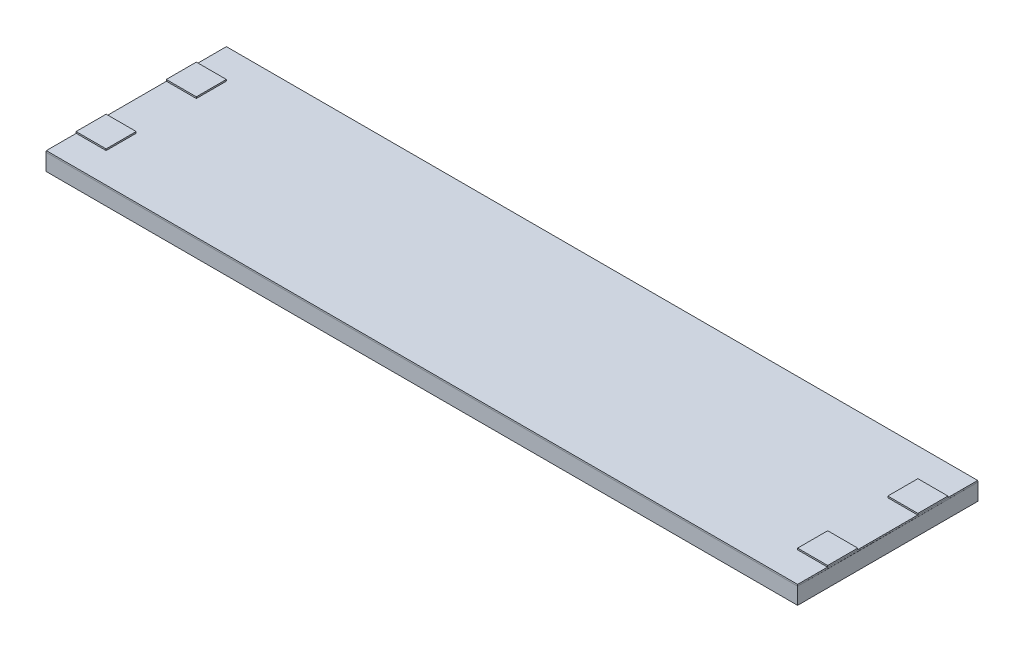
ISO-10303-21;
HEADER;
FILE_DESCRIPTION(('STEP AP214'),'2;1');
FILE_NAME('part.step','',(''),(''),'','','');
FILE_SCHEMA(('AUTOMOTIVE_DESIGN { 1 0 10303 214 1 1 1 1 }'));
ENDSEC;
DATA;
#1=APPLICATION_CONTEXT('core data for automotive mechanical design processes');
#2=APPLICATION_PROTOCOL_DEFINITION('international standard','automotive_design',2000,#1);
#3=PRODUCT_CONTEXT('',#1,'mechanical');
#4=PRODUCT('Part','Part','',(#3));
#5=PRODUCT_RELATED_PRODUCT_CATEGORY('part','',(#4));
#6=PRODUCT_DEFINITION_FORMATION('','',#4);
#7=PRODUCT_DEFINITION_CONTEXT('part definition',#1,'design');
#8=PRODUCT_DEFINITION('design','',#6,#7);
#9=PRODUCT_DEFINITION_SHAPE('','',#8);
#10=(LENGTH_UNIT() NAMED_UNIT(*) SI_UNIT(.MILLI.,.METRE.));
#11=(NAMED_UNIT(*) PLANE_ANGLE_UNIT() SI_UNIT($,.RADIAN.));
#12=(NAMED_UNIT(*) SI_UNIT($,.STERADIAN.) SOLID_ANGLE_UNIT());
#13=UNCERTAINTY_MEASURE_WITH_UNIT(LENGTH_MEASURE(1.E-05),#10,'distance_accuracy_value','');
#14=(GEOMETRIC_REPRESENTATION_CONTEXT(3) GLOBAL_UNCERTAINTY_ASSIGNED_CONTEXT((#13)) GLOBAL_UNIT_ASSIGNED_CONTEXT((#10,
#11,#12)) REPRESENTATION_CONTEXT('',''));
#15=CARTESIAN_POINT('',(0.,0.,0.));
#16=DIRECTION('',(0.,0.,1.));
#17=DIRECTION('',(1.,0.,0.));
#18=AXIS2_PLACEMENT_3D('',#15,#16,#17);
#19=CARTESIAN_POINT('',(0.,1.2,0.));
#20=DIRECTION('',(0.,1.,0.));
#21=DIRECTION('',(0.,0.,1.));
#22=AXIS2_PLACEMENT_3D('',#19,#20,#21);
#23=PLANE('',#22);
#24=DIRECTION('',(0.,0.,1.));
#25=VECTOR('',#24,1.);
#26=CARTESIAN_POINT('',(48.,1.2,-9.99999999999999));
#27=LINE('',#26,#25);
#28=CARTESIAN_POINT('',(48.,1.2,-9.99999999999999));
#29=VERTEX_POINT('',#28);
#30=CARTESIAN_POINT('',(48.,1.2,-7.99999999999999));
#31=VERTEX_POINT('',#30);
#32=EDGE_CURVE('E48',#29,#31,#27,.T.);
#33=ORIENTED_EDGE('',*,*,#32,.F.);
#34=DIRECTION('',(-1.,0.,0.));
#35=VECTOR('',#34,1.);
#36=CARTESIAN_POINT('',(48.,1.2,-9.99999999999999));
#37=LINE('',#36,#35);
#38=CARTESIAN_POINT('',(49.99,1.2,-9.99999999999999));
#39=VERTEX_POINT('',#38);
#40=EDGE_CURVE('E229',#39,#29,#37,.T.);
#41=ORIENTED_EDGE('',*,*,#40,.F.);
#42=DIRECTION('',(0.,0.,-1.));
#43=VECTOR('',#42,1.);
#44=CARTESIAN_POINT('',(49.99,1.2,0.));
#45=LINE('',#44,#43);
#46=CARTESIAN_POINT('',(49.99,1.2,-11.99));
#47=VERTEX_POINT('',#46);
#48=EDGE_CURVE('E340',#39,#47,#45,.T.);
#49=ORIENTED_EDGE('',*,*,#48,.T.);
#50=DIRECTION('',(-1.,0.,0.));
#51=VECTOR('',#50,1.);
#52=CARTESIAN_POINT('',(0.,1.2,-11.99));
#53=LINE('',#52,#51);
#54=CARTESIAN_POINT('',(0.01,1.2,-11.99));
#55=VERTEX_POINT('',#54);
#56=EDGE_CURVE('E338',#47,#55,#53,.T.);
#57=ORIENTED_EDGE('',*,*,#56,.T.);
#58=DIRECTION('',(0.,0.,1.));
#59=VECTOR('',#58,1.);
#60=CARTESIAN_POINT('',(0.01,1.2,0.));
#61=LINE('',#60,#59);
#62=CARTESIAN_POINT('',(0.01,1.2,-10.));
#63=VERTEX_POINT('',#62);
#64=EDGE_CURVE('E343',#55,#63,#61,.T.);
#65=ORIENTED_EDGE('',*,*,#64,.T.);
#66=DIRECTION('',(-1.,0.,0.));
#67=VECTOR('',#66,1.);
#68=CARTESIAN_POINT('',(2.,1.2,-10.));
#69=LINE('',#68,#67);
#70=CARTESIAN_POINT('',(2.,1.2,-10.));
#71=VERTEX_POINT('',#70);
#72=EDGE_CURVE('E316',#71,#63,#69,.T.);
#73=ORIENTED_EDGE('',*,*,#72,.F.);
#74=DIRECTION('',(0.,0.,-1.));
#75=VECTOR('',#74,1.);
#76=CARTESIAN_POINT('',(2.,1.2,-10.));
#77=LINE('',#76,#75);
#78=CARTESIAN_POINT('',(2.,1.2,-8.));
#79=VERTEX_POINT('',#78);
#80=EDGE_CURVE('E301',#79,#71,#77,.T.);
#81=ORIENTED_EDGE('',*,*,#80,.F.);
#82=DIRECTION('',(1.,0.,0.));
#83=VECTOR('',#82,1.);
#84=CARTESIAN_POINT('',(2.,1.2,-8.));
#85=LINE('',#84,#83);
#86=CARTESIAN_POINT('',(0.01,1.2,-8.));
#87=VERTEX_POINT('',#86);
#88=EDGE_CURVE('E41',#87,#79,#85,.T.);
#89=ORIENTED_EDGE('',*,*,#88,.F.);
#90=CARTESIAN_POINT('',(0.01,1.2,-4.));
#91=VERTEX_POINT('',#90);
#92=EDGE_CURVE('E859',#87,#91,#61,.T.);
#93=ORIENTED_EDGE('',*,*,#92,.T.);
#94=DIRECTION('',(-1.,0.,0.));
#95=VECTOR('',#94,1.);
#96=CARTESIAN_POINT('',(2.,1.2,-4.));
#97=LINE('',#96,#95);
#98=CARTESIAN_POINT('',(2.,1.2,-4.));
#99=VERTEX_POINT('',#98);
#100=EDGE_CURVE('E287',#99,#91,#97,.T.);
#101=ORIENTED_EDGE('',*,*,#100,.F.);
#102=DIRECTION('',(0.,0.,-1.));
#103=VECTOR('',#102,1.);
#104=CARTESIAN_POINT('',(2.,1.2,-2.));
#105=LINE('',#104,#103);
#106=CARTESIAN_POINT('',(2.,1.2,-2.));
#107=VERTEX_POINT('',#106);
#108=EDGE_CURVE('E283',#107,#99,#105,.T.);
#109=ORIENTED_EDGE('',*,*,#108,.F.);
#110=DIRECTION('',(-1.,0.,0.));
#111=VECTOR('',#110,1.);
#112=CARTESIAN_POINT('',(0.,1.2,-2.));
#113=LINE('',#112,#111);
#114=CARTESIAN_POINT('',(0.01,1.2,-2.));
#115=VERTEX_POINT('',#114);
#116=EDGE_CURVE('E11',#107,#115,#113,.T.);
#117=ORIENTED_EDGE('',*,*,#116,.T.);
#118=CARTESIAN_POINT('',(0.01,1.2,-0.01));
#119=VERTEX_POINT('',#118);
#120=EDGE_CURVE('E342',#115,#119,#61,.T.);
#121=ORIENTED_EDGE('',*,*,#120,.T.);
#122=DIRECTION('',(1.,0.,0.));
#123=VECTOR('',#122,1.);
#124=CARTESIAN_POINT('',(0.,1.2,-0.01));
#125=LINE('',#124,#123);
#126=CARTESIAN_POINT('',(49.99,1.2,-0.01));
#127=VERTEX_POINT('',#126);
#128=EDGE_CURVE('E345',#119,#127,#125,.T.);
#129=ORIENTED_EDGE('',*,*,#128,.T.);
#130=CARTESIAN_POINT('',(49.99,1.2,-2.));
#131=VERTEX_POINT('',#130);
#132=EDGE_CURVE('E335',#127,#131,#45,.T.);
#133=ORIENTED_EDGE('',*,*,#132,.T.);
#134=DIRECTION('',(1.,0.,0.));
#135=VECTOR('',#134,1.);
#136=CARTESIAN_POINT('',(48.,1.2,-2.));
#137=LINE('',#136,#135);
#138=CARTESIAN_POINT('',(48.,1.2,-2.));
#139=VERTEX_POINT('',#138);
#140=EDGE_CURVE('E250',#139,#131,#137,.T.);
#141=ORIENTED_EDGE('',*,*,#140,.F.);
#142=DIRECTION('',(0.,0.,1.));
#143=VECTOR('',#142,1.);
#144=CARTESIAN_POINT('',(48.,1.2,-2.));
#145=LINE('',#144,#143);
#146=CARTESIAN_POINT('',(48.,1.2,-4.));
#147=VERTEX_POINT('',#146);
#148=EDGE_CURVE('E230',#147,#139,#145,.T.);
#149=ORIENTED_EDGE('',*,*,#148,.F.);
#150=DIRECTION('',(-1.,0.,0.));
#151=VECTOR('',#150,1.);
#152=CARTESIAN_POINT('',(48.,1.2,-4.));
#153=LINE('',#152,#151);
#154=CARTESIAN_POINT('',(49.99,1.2,-4.));
#155=VERTEX_POINT('',#154);
#156=EDGE_CURVE('E255',#155,#147,#153,.T.);
#157=ORIENTED_EDGE('',*,*,#156,.F.);
#158=CARTESIAN_POINT('',(49.99,1.2,-7.99999999999999));
#159=VERTEX_POINT('',#158);
#160=EDGE_CURVE('E827',#155,#159,#45,.T.);
#161=ORIENTED_EDGE('',*,*,#160,.T.);
#162=DIRECTION('',(1.,0.,0.));
#163=VECTOR('',#162,1.);
#164=CARTESIAN_POINT('',(48.,1.2,-7.99999999999999));
#165=LINE('',#164,#163);
#166=EDGE_CURVE('E53',#31,#159,#165,.T.);
#167=ORIENTED_EDGE('',*,*,#166,.F.);
#168=EDGE_LOOP('',(#33,#41,#49,#57,#65,#73,#81,#89,#93,#101,#109,#117,#121,#129,#133,#141,#149,
#157,#161,#167));
#169=FACE_BOUND('',#168,.T.);
#170=ADVANCED_FACE('F32',(#169),#23,.T.);
#171=CARTESIAN_POINT('',(0.,1.1,0.));
#172=DIRECTION('',(0.,-1.,0.));
#173=DIRECTION('',(0.,0.,-1.));
#174=AXIS2_PLACEMENT_3D('',#171,#172,#173);
#175=PLANE('',#174);
#176=DIRECTION('',(0.,0.,-1.));
#177=VECTOR('',#176,1.);
#178=CARTESIAN_POINT('',(49.99,1.1,0.));
#179=LINE('',#178,#177);
#180=CARTESIAN_POINT('',(49.995,1.1,-0.005));
#181=VERTEX_POINT('',#180);
#182=CARTESIAN_POINT('',(49.9935355339059,1.1,-11.9935355339059));
#183=VERTEX_POINT('',#182);
#184=EDGE_CURVE('E334',#181,#183,#179,.T.);
#185=ORIENTED_EDGE('',*,*,#184,.F.);
#186=DIRECTION('',(0.,0.,-1.));
#187=VECTOR('',#186,1.);
#188=CARTESIAN_POINT('',(50.,1.1,0.));
#189=LINE('',#188,#187);
#190=EDGE_CURVE('E480',#181,#183,#189,.T.);
#191=ORIENTED_EDGE('',*,*,#190,.T.);
#192=EDGE_LOOP('',(#185,#191));
#193=FACE_BOUND('',#192,.T.);
#194=ADVANCED_FACE('F484',(#193),#175,.F.);
#195=CARTESIAN_POINT('',(0.,1.1,0.));
#196=DIRECTION('',(1.,0.,0.));
#197=DIRECTION('',(0.,0.,-1.));
#198=AXIS2_PLACEMENT_3D('',#195,#196,#197);
#199=PLANE('',#198);
#200=DIRECTION('',(0.,0.,1.));
#201=VECTOR('',#200,1.);
#202=CARTESIAN_POINT('',(0.,0.,0.));
#203=LINE('',#202,#201);
#204=CARTESIAN_POINT('',(0.,0.,-12.));
#205=VERTEX_POINT('',#204);
#206=CARTESIAN_POINT('',(0.,0.,0.));
#207=VERTEX_POINT('',#206);
#208=EDGE_CURVE('E398',#205,#207,#203,.T.);
#209=ORIENTED_EDGE('',*,*,#208,.T.);
#210=DIRECTION('',(0.,-1.,0.));
#211=VECTOR('',#210,1.);
#212=CARTESIAN_POINT('',(0.,1.1,0.));
#213=LINE('',#212,#211);
#214=CARTESIAN_POINT('',(0.005,1.1,-0.005));
#215=VERTEX_POINT('',#214);
#216=EDGE_CURVE('E427',#215,#207,#213,.T.);
#217=ORIENTED_EDGE('',*,*,#216,.F.);
#218=CARTESIAN_POINT('',(0.01,1.1,-11.99));
#219=DIRECTION('',(0.,0.,1.));
#220=VECTOR('',#219,1.);
#221=LINE('',#218,#220);
#222=CARTESIAN_POINT('',(0.005,1.1,-11.995));
#223=VERTEX_POINT('',#222);
#224=EDGE_CURVE('E355',#223,#215,#221,.T.);
#225=ORIENTED_EDGE('',*,*,#224,.F.);
#226=DIRECTION('',(0.,-1.,0.));
#227=VECTOR('',#226,1.);
#228=CARTESIAN_POINT('',(0.,1.1,-12.));
#229=LINE('',#228,#227);
#230=EDGE_CURVE('E416',#223,#205,#229,.T.);
#231=ORIENTED_EDGE('',*,*,#230,.T.);
#232=EDGE_LOOP('',(#209,#217,#225,#231));
#233=FACE_BOUND('',#232,.T.);
#234=ADVANCED_FACE('F34',(#233),#199,.F.);
#235=CARTESIAN_POINT('',(0.,1.1,0.));
#236=DIRECTION('',(0.,0.,-1.));
#237=DIRECTION('',(-1.,0.,0.));
#238=AXIS2_PLACEMENT_3D('',#235,#236,#237);
#239=PLANE('',#238);
#240=DIRECTION('',(1.,0.,0.));
#241=VECTOR('',#240,1.);
#242=CARTESIAN_POINT('',(0.,0.,0.));
#243=LINE('',#242,#241);
#244=CARTESIAN_POINT('',(50.,0.,0.));
#245=VERTEX_POINT('',#244);
#246=EDGE_CURVE('E403',#207,#245,#243,.T.);
#247=ORIENTED_EDGE('',*,*,#246,.T.);
#248=DIRECTION('',(0.,-1.,0.));
#249=VECTOR('',#248,1.);
#250=CARTESIAN_POINT('',(50.,1.1,0.));
#251=LINE('',#250,#249);
#252=EDGE_CURVE('E430',#181,#245,#251,.T.);
#253=ORIENTED_EDGE('',*,*,#252,.F.);
#254=CARTESIAN_POINT('',(0.01,1.1,-0.01));
#255=DIRECTION('',(1.,0.,0.));
#256=VECTOR('',#255,1.);
#257=LINE('',#254,#256);
#258=EDGE_CURVE('E437',#215,#181,#257,.T.);
#259=ORIENTED_EDGE('',*,*,#258,.F.);
#260=ORIENTED_EDGE('',*,*,#216,.T.);
#261=EDGE_LOOP('',(#247,#253,#259,#260));
#262=FACE_BOUND('',#261,.T.);
#263=ADVANCED_FACE('F442',(#262),#239,.F.);
#264=CARTESIAN_POINT('',(50.,1.1,0.));
#265=DIRECTION('',(-1.,0.,0.));
#266=DIRECTION('',(0.,0.,1.));
#267=AXIS2_PLACEMENT_3D('',#264,#265,#266);
#268=PLANE('',#267);
#269=DIRECTION('',(0.,0.,-1.));
#270=VECTOR('',#269,1.);
#271=CARTESIAN_POINT('',(50.,0.,0.));
#272=LINE('',#271,#270);
#273=CARTESIAN_POINT('',(50.,0.,-12.));
#274=VERTEX_POINT('',#273);
#275=EDGE_CURVE('E405',#245,#274,#272,.T.);
#276=ORIENTED_EDGE('',*,*,#275,.T.);
#277=DIRECTION('',(0.,-1.,0.));
#278=VECTOR('',#277,1.);
#279=CARTESIAN_POINT('',(50.,1.1,-12.));
#280=LINE('',#279,#278);
#281=EDGE_CURVE('E423',#183,#274,#280,.T.);
#282=ORIENTED_EDGE('',*,*,#281,.F.);
#283=ORIENTED_EDGE('',*,*,#190,.F.);
#284=ORIENTED_EDGE('',*,*,#252,.T.);
#285=EDGE_LOOP('',(#276,#282,#283,#284));
#286=FACE_BOUND('',#285,.T.);
#287=ADVANCED_FACE('F451',(#286),#268,.F.);
#288=CARTESIAN_POINT('',(0.,1.1,-12.));
#289=DIRECTION('',(0.,0.,1.));
#290=DIRECTION('',(1.,0.,0.));
#291=AXIS2_PLACEMENT_3D('',#288,#289,#290);
#292=PLANE('',#291);
#293=DIRECTION('',(-1.,0.,0.));
#294=VECTOR('',#293,1.);
#295=CARTESIAN_POINT('',(0.,0.,-12.));
#296=LINE('',#295,#294);
#297=EDGE_CURVE('E407',#274,#205,#296,.T.);
#298=ORIENTED_EDGE('',*,*,#297,.T.);
#299=ORIENTED_EDGE('',*,*,#230,.F.);
#300=CARTESIAN_POINT('',(49.99,1.1,-11.99));
#301=DIRECTION('',(-1.,0.,0.));
#302=VECTOR('',#301,1.);
#303=LINE('',#300,#302);
#304=EDGE_CURVE('E424',#183,#223,#303,.T.);
#305=ORIENTED_EDGE('',*,*,#304,.F.);
#306=ORIENTED_EDGE('',*,*,#281,.T.);
#307=EDGE_LOOP('',(#298,#299,#305,#306));
#308=FACE_BOUND('',#307,.T.);
#309=ADVANCED_FACE('F454',(#308),#292,.F.);
#310=CARTESIAN_POINT('',(0.,0.,0.));
#311=DIRECTION('',(0.,-1.,0.));
#312=DIRECTION('',(0.,0.,-1.));
#313=AXIS2_PLACEMENT_3D('',#310,#311,#312);
#314=PLANE('',#313);
#315=ORIENTED_EDGE('',*,*,#208,.F.);
#316=ORIENTED_EDGE('',*,*,#297,.F.);
#317=ORIENTED_EDGE('',*,*,#275,.F.);
#318=ORIENTED_EDGE('',*,*,#246,.F.);
#319=EDGE_LOOP('',(#315,#316,#317,#318));
#320=FACE_BOUND('',#319,.T.);
#321=ADVANCED_FACE('F459',(#320),#314,.T.);
#322=CARTESIAN_POINT('',(49.99,1.2,0.));
#323=DIRECTION('',(-1.,0.,0.));
#324=DIRECTION('',(0.,0.,1.));
#325=AXIS2_PLACEMENT_3D('',#322,#323,#324);
#326=PLANE('',#325);
#327=ORIENTED_EDGE('',*,*,#184,.T.);
#328=DIRECTION('',(0.,-1.,0.));
#329=VECTOR('',#328,1.);
#330=CARTESIAN_POINT('',(49.99,1.2,-11.99));
#331=LINE('',#330,#329);
#332=EDGE_CURVE('E390',#47,#183,#331,.T.);
#333=ORIENTED_EDGE('',*,*,#332,.F.);
#334=ORIENTED_EDGE('',*,*,#48,.F.);
#335=EDGE_CURVE('E799',#159,#39,#45,.T.);
#336=ORIENTED_EDGE('',*,*,#335,.F.);
#337=ORIENTED_EDGE('',*,*,#160,.F.);
#338=EDGE_CURVE('E339',#131,#155,#45,.T.);
#339=ORIENTED_EDGE('',*,*,#338,.F.);
#340=ORIENTED_EDGE('',*,*,#132,.F.);
#341=DIRECTION('',(0.,-1.,0.));
#342=VECTOR('',#341,1.);
#343=CARTESIAN_POINT('',(49.99,1.2,-0.01));
#344=LINE('',#343,#342);
#345=EDGE_CURVE('E348',#127,#181,#344,.T.);
#346=ORIENTED_EDGE('',*,*,#345,.T.);
#347=EDGE_LOOP('',(#327,#333,#334,#336,#337,#339,#340,#346));
#348=FACE_BOUND('',#347,.T.);
#349=ADVANCED_FACE('F380',(#348),#326,.F.);
#350=CARTESIAN_POINT('',(0.,1.2,-11.99));
#351=DIRECTION('',(0.,0.,1.));
#352=DIRECTION('',(1.,0.,0.));
#353=AXIS2_PLACEMENT_3D('',#350,#351,#352);
#354=PLANE('',#353);
#355=ORIENTED_EDGE('',*,*,#304,.T.);
#356=DIRECTION('',(0.,-1.,0.));
#357=VECTOR('',#356,1.);
#358=CARTESIAN_POINT('',(0.01,1.2,-11.99));
#359=LINE('',#358,#357);
#360=EDGE_CURVE('E361',#55,#223,#359,.T.);
#361=ORIENTED_EDGE('',*,*,#360,.F.);
#362=ORIENTED_EDGE('',*,*,#56,.F.);
#363=ORIENTED_EDGE('',*,*,#332,.T.);
#364=EDGE_LOOP('',(#355,#361,#362,#363));
#365=FACE_BOUND('',#364,.T.);
#366=ADVANCED_FACE('F374',(#365),#354,.F.);
#367=CARTESIAN_POINT('',(0.01,1.2,0.));
#368=DIRECTION('',(1.,0.,0.));
#369=DIRECTION('',(0.,0.,-1.));
#370=AXIS2_PLACEMENT_3D('',#367,#368,#369);
#371=PLANE('',#370);
#372=ORIENTED_EDGE('',*,*,#224,.T.);
#373=DIRECTION('',(0.,-1.,0.));
#374=VECTOR('',#373,1.);
#375=CARTESIAN_POINT('',(0.01,1.2,-0.01));
#376=LINE('',#375,#374);
#377=EDGE_CURVE('E805',#119,#215,#376,.T.);
#378=ORIENTED_EDGE('',*,*,#377,.F.);
#379=ORIENTED_EDGE('',*,*,#120,.F.);
#380=EDGE_CURVE('E858',#91,#115,#61,.T.);
#381=ORIENTED_EDGE('',*,*,#380,.F.);
#382=ORIENTED_EDGE('',*,*,#92,.F.);
#383=EDGE_CURVE('E346',#63,#87,#61,.T.);
#384=ORIENTED_EDGE('',*,*,#383,.F.);
#385=ORIENTED_EDGE('',*,*,#64,.F.);
#386=ORIENTED_EDGE('',*,*,#360,.T.);
#387=EDGE_LOOP('',(#372,#378,#379,#381,#382,#384,#385,#386));
#388=FACE_BOUND('',#387,.T.);
#389=ADVANCED_FACE('F363',(#388),#371,.F.);
#390=CARTESIAN_POINT('',(0.,1.2,-0.01));
#391=DIRECTION('',(0.,0.,-1.));
#392=DIRECTION('',(-1.,0.,0.));
#393=AXIS2_PLACEMENT_3D('',#390,#391,#392);
#394=PLANE('',#393);
#395=ORIENTED_EDGE('',*,*,#258,.T.);
#396=ORIENTED_EDGE('',*,*,#345,.F.);
#397=ORIENTED_EDGE('',*,*,#128,.F.);
#398=ORIENTED_EDGE('',*,*,#377,.T.);
#399=EDGE_LOOP('',(#395,#396,#397,#398));
#400=FACE_BOUND('',#399,.T.);
#401=ADVANCED_FACE('F373',(#400),#394,.F.);
#402=CARTESIAN_POINT('',(2.,1.3,-10.));
#403=DIRECTION('',(-1.,0.,0.));
#404=DIRECTION('',(0.,0.,1.));
#405=AXIS2_PLACEMENT_3D('',#402,#403,#404);
#406=PLANE('',#405);
#407=ORIENTED_EDGE('',*,*,#80,.T.);
#408=DIRECTION('',(0.,-1.,0.));
#409=VECTOR('',#408,1.);
#410=CARTESIAN_POINT('',(2.,1.3,-10.));
#411=LINE('',#410,#409);
#412=CARTESIAN_POINT('',(2.,1.3,-10.));
#413=VERTEX_POINT('',#412);
#414=EDGE_CURVE('E331',#413,#71,#411,.T.);
#415=ORIENTED_EDGE('',*,*,#414,.F.);
#416=DIRECTION('',(0.,0.,-1.));
#417=VECTOR('',#416,1.);
#418=CARTESIAN_POINT('',(2.,1.3,-10.));
#419=LINE('',#418,#417);
#420=CARTESIAN_POINT('',(2.,1.3,-8.));
#421=VERTEX_POINT('',#420);
#422=EDGE_CURVE('E302',#421,#413,#419,.T.);
#423=ORIENTED_EDGE('',*,*,#422,.F.);
#424=DIRECTION('',(0.,-1.,0.));
#425=VECTOR('',#424,1.);
#426=CARTESIAN_POINT('',(2.,1.3,-8.));
#427=LINE('',#426,#425);
#428=EDGE_CURVE('E312',#421,#79,#427,.T.);
#429=ORIENTED_EDGE('',*,*,#428,.T.);
#430=EDGE_LOOP('',(#407,#415,#423,#429));
#431=FACE_BOUND('',#430,.T.);
#432=ADVANCED_FACE('F493',(#431),#406,.F.);
#433=CARTESIAN_POINT('',(2.,1.3,-10.));
#434=DIRECTION('',(0.,0.,1.));
#435=DIRECTION('',(1.,0.,0.));
#436=AXIS2_PLACEMENT_3D('',#433,#434,#435);
#437=PLANE('',#436);
#438=ORIENTED_EDGE('',*,*,#72,.T.);
#439=CARTESIAN_POINT('',(0.,1.2,-10.));
#440=VERTEX_POINT('',#439);
#441=EDGE_CURVE('E315',#63,#440,#69,.T.);
#442=ORIENTED_EDGE('',*,*,#441,.T.);
#443=DIRECTION('',(0.,-1.,0.));
#444=VECTOR('',#443,1.);
#445=CARTESIAN_POINT('',(0.,1.3,-10.));
#446=LINE('',#445,#444);
#447=CARTESIAN_POINT('',(0.,1.3,-10.));
#448=VERTEX_POINT('',#447);
#449=EDGE_CURVE('E328',#448,#440,#446,.T.);
#450=ORIENTED_EDGE('',*,*,#449,.F.);
#451=DIRECTION('',(-1.,0.,0.));
#452=VECTOR('',#451,1.);
#453=CARTESIAN_POINT('',(2.,1.3,-10.));
#454=LINE('',#453,#452);
#455=EDGE_CURVE('E305',#413,#448,#454,.T.);
#456=ORIENTED_EDGE('',*,*,#455,.F.);
#457=ORIENTED_EDGE('',*,*,#414,.T.);
#458=EDGE_LOOP('',(#438,#442,#450,#456,#457));
#459=FACE_BOUND('',#458,.T.);
#460=ADVANCED_FACE('F496',(#459),#437,.F.);
#461=CARTESIAN_POINT('',(0.,1.3,-10.));
#462=DIRECTION('',(1.,0.,0.));
#463=DIRECTION('',(0.,0.,-1.));
#464=AXIS2_PLACEMENT_3D('',#461,#462,#463);
#465=PLANE('',#464);
#466=DIRECTION('',(0.,0.,1.));
#467=VECTOR('',#466,1.);
#468=CARTESIAN_POINT('',(0.,1.2,-10.));
#469=LINE('',#468,#467);
#470=CARTESIAN_POINT('',(0.,1.2,-8.));
#471=VERTEX_POINT('',#470);
#472=EDGE_CURVE('E319',#440,#471,#469,.T.);
#473=ORIENTED_EDGE('',*,*,#472,.T.);
#474=DIRECTION('',(0.,-1.,0.));
#475=VECTOR('',#474,1.);
#476=CARTESIAN_POINT('',(0.,1.3,-8.));
#477=LINE('',#476,#475);
#478=CARTESIAN_POINT('',(0.,1.3,-8.));
#479=VERTEX_POINT('',#478);
#480=EDGE_CURVE('E325',#479,#471,#477,.T.);
#481=ORIENTED_EDGE('',*,*,#480,.F.);
#482=DIRECTION('',(0.,0.,1.));
#483=VECTOR('',#482,1.);
#484=CARTESIAN_POINT('',(0.,1.3,-10.));
#485=LINE('',#484,#483);
#486=EDGE_CURVE('E308',#448,#479,#485,.T.);
#487=ORIENTED_EDGE('',*,*,#486,.F.);
#488=ORIENTED_EDGE('',*,*,#449,.T.);
#489=EDGE_LOOP('',(#473,#481,#487,#488));
#490=FACE_BOUND('',#489,.T.);
#491=ADVANCED_FACE('F500',(#490),#465,.F.);
#492=CARTESIAN_POINT('',(2.,1.3,-8.));
#493=DIRECTION('',(0.,0.,-1.));
#494=DIRECTION('',(-1.,0.,0.));
#495=AXIS2_PLACEMENT_3D('',#492,#493,#494);
#496=PLANE('',#495);
#497=EDGE_CURVE('E306',#471,#87,#85,.T.);
#498=ORIENTED_EDGE('',*,*,#497,.T.);
#499=ORIENTED_EDGE('',*,*,#88,.T.);
#500=ORIENTED_EDGE('',*,*,#428,.F.);
#501=DIRECTION('',(1.,0.,0.));
#502=VECTOR('',#501,1.);
#503=CARTESIAN_POINT('',(2.,1.3,-8.));
#504=LINE('',#503,#502);
#505=EDGE_CURVE('E310',#479,#421,#504,.T.);
#506=ORIENTED_EDGE('',*,*,#505,.F.);
#507=ORIENTED_EDGE('',*,*,#480,.T.);
#508=EDGE_LOOP('',(#498,#499,#500,#506,#507));
#509=FACE_BOUND('',#508,.T.);
#510=ADVANCED_FACE('F504',(#509),#496,.F.);
#511=CARTESIAN_POINT('',(0.,1.3,0.));
#512=DIRECTION('',(0.,-1.,0.));
#513=DIRECTION('',(0.,0.,-1.));
#514=AXIS2_PLACEMENT_3D('',#511,#512,#513);
#515=PLANE('',#514);
#516=ORIENTED_EDGE('',*,*,#422,.T.);
#517=ORIENTED_EDGE('',*,*,#455,.T.);
#518=ORIENTED_EDGE('',*,*,#486,.T.);
#519=ORIENTED_EDGE('',*,*,#505,.T.);
#520=EDGE_LOOP('',(#516,#517,#518,#519));
#521=FACE_BOUND('',#520,.T.);
#522=ADVANCED_FACE('F508',(#521),#515,.F.);
#523=CARTESIAN_POINT('',(0.,1.2,0.));
#524=DIRECTION('',(0.,-1.,0.));
#525=DIRECTION('',(0.,0.,-1.));
#526=AXIS2_PLACEMENT_3D('',#523,#524,#525);
#527=PLANE('',#526);
#528=ORIENTED_EDGE('',*,*,#441,.F.);
#529=ORIENTED_EDGE('',*,*,#383,.T.);
#530=ORIENTED_EDGE('',*,*,#497,.F.);
#531=ORIENTED_EDGE('',*,*,#472,.F.);
#532=EDGE_LOOP('',(#528,#529,#530,#531));
#533=FACE_BOUND('',#532,.T.);
#534=ADVANCED_FACE('F510',(#533),#527,.T.);
#535=CARTESIAN_POINT('',(0.,1.2,0.));
#536=DIRECTION('',(0.,-1.,0.));
#537=DIRECTION('',(0.,0.,-1.));
#538=AXIS2_PLACEMENT_3D('',#535,#536,#537);
#539=PLANE('',#538);
#540=ORIENTED_EDGE('',*,*,#380,.T.);
#541=DIRECTION('',(1.,0.,0.));
#542=VECTOR('',#541,1.);
#543=CARTESIAN_POINT('',(2.,1.2,-2.));
#544=LINE('',#543,#542);
#545=CARTESIAN_POINT('',(0.,1.2,-2.));
#546=VERTEX_POINT('',#545);
#547=EDGE_CURVE('E269',#546,#115,#544,.T.);
#548=ORIENTED_EDGE('',*,*,#547,.F.);
#549=DIRECTION('',(0.,0.,1.));
#550=VECTOR('',#549,1.);
#551=CARTESIAN_POINT('',(0.,1.2,-2.));
#552=LINE('',#551,#550);
#553=CARTESIAN_POINT('',(0.,1.2,-4.));
#554=VERTEX_POINT('',#553);
#555=EDGE_CURVE('E274',#554,#546,#552,.T.);
#556=ORIENTED_EDGE('',*,*,#555,.F.);
#557=EDGE_CURVE('E286',#91,#554,#97,.T.);
#558=ORIENTED_EDGE('',*,*,#557,.F.);
#559=EDGE_LOOP('',(#540,#548,#556,#558));
#560=FACE_BOUND('',#559,.T.);
#561=ADVANCED_FACE('F513',(#560),#539,.T.);
#562=CARTESIAN_POINT('',(2.,1.3,-2.));
#563=DIRECTION('',(0.,0.,-1.));
#564=DIRECTION('',(-1.,0.,0.));
#565=AXIS2_PLACEMENT_3D('',#562,#563,#564);
#566=PLANE('',#565);
#567=ORIENTED_EDGE('',*,*,#547,.T.);
#568=ORIENTED_EDGE('',*,*,#116,.F.);
#569=DIRECTION('',(0.,-1.,0.));
#570=VECTOR('',#569,1.);
#571=CARTESIAN_POINT('',(2.,1.3,-2.));
#572=LINE('',#571,#570);
#573=CARTESIAN_POINT('',(2.,1.3,-2.));
#574=VERTEX_POINT('',#573);
#575=EDGE_CURVE('E298',#574,#107,#572,.T.);
#576=ORIENTED_EDGE('',*,*,#575,.F.);
#577=DIRECTION('',(1.,0.,0.));
#578=VECTOR('',#577,1.);
#579=CARTESIAN_POINT('',(2.,1.3,-2.));
#580=LINE('',#579,#578);
#581=CARTESIAN_POINT('',(0.,1.3,-2.));
#582=VERTEX_POINT('',#581);
#583=EDGE_CURVE('E270',#582,#574,#580,.T.);
#584=ORIENTED_EDGE('',*,*,#583,.F.);
#585=DIRECTION('',(0.,-1.,0.));
#586=VECTOR('',#585,1.);
#587=CARTESIAN_POINT('',(0.,1.3,-2.));
#588=LINE('',#587,#586);
#589=EDGE_CURVE('E280',#582,#546,#588,.T.);
#590=ORIENTED_EDGE('',*,*,#589,.T.);
#591=EDGE_LOOP('',(#567,#568,#576,#584,#590));
#592=FACE_BOUND('',#591,.T.);
#593=ADVANCED_FACE('F518',(#592),#566,.F.);
#594=CARTESIAN_POINT('',(2.,1.3,-2.));
#595=DIRECTION('',(-1.,0.,0.));
#596=DIRECTION('',(0.,0.,1.));
#597=AXIS2_PLACEMENT_3D('',#594,#595,#596);
#598=PLANE('',#597);
#599=ORIENTED_EDGE('',*,*,#108,.T.);
#600=DIRECTION('',(0.,-1.,0.));
#601=VECTOR('',#600,1.);
#602=CARTESIAN_POINT('',(2.,1.3,-4.));
#603=LINE('',#602,#601);
#604=CARTESIAN_POINT('',(2.,1.3,-4.));
#605=VERTEX_POINT('',#604);
#606=EDGE_CURVE('E296',#605,#99,#603,.T.);
#607=ORIENTED_EDGE('',*,*,#606,.F.);
#608=DIRECTION('',(0.,0.,-1.));
#609=VECTOR('',#608,1.);
#610=CARTESIAN_POINT('',(2.,1.3,-2.));
#611=LINE('',#610,#609);
#612=EDGE_CURVE('E273',#574,#605,#611,.T.);
#613=ORIENTED_EDGE('',*,*,#612,.F.);
#614=ORIENTED_EDGE('',*,*,#575,.T.);
#615=EDGE_LOOP('',(#599,#607,#613,#614));
#616=FACE_BOUND('',#615,.T.);
#617=ADVANCED_FACE('F521',(#616),#598,.F.);
#618=CARTESIAN_POINT('',(2.,1.3,-4.));
#619=DIRECTION('',(0.,0.,1.));
#620=DIRECTION('',(1.,0.,0.));
#621=AXIS2_PLACEMENT_3D('',#618,#619,#620);
#622=PLANE('',#621);
#623=ORIENTED_EDGE('',*,*,#100,.T.);
#624=ORIENTED_EDGE('',*,*,#557,.T.);
#625=DIRECTION('',(0.,-1.,0.));
#626=VECTOR('',#625,1.);
#627=CARTESIAN_POINT('',(0.,1.3,-4.));
#628=LINE('',#627,#626);
#629=CARTESIAN_POINT('',(0.,1.3,-4.));
#630=VERTEX_POINT('',#629);
#631=EDGE_CURVE('E293',#630,#554,#628,.T.);
#632=ORIENTED_EDGE('',*,*,#631,.F.);
#633=DIRECTION('',(-1.,0.,0.));
#634=VECTOR('',#633,1.);
#635=CARTESIAN_POINT('',(2.,1.3,-4.));
#636=LINE('',#635,#634);
#637=EDGE_CURVE('E276',#605,#630,#636,.T.);
#638=ORIENTED_EDGE('',*,*,#637,.F.);
#639=ORIENTED_EDGE('',*,*,#606,.T.);
#640=EDGE_LOOP('',(#623,#624,#632,#638,#639));
#641=FACE_BOUND('',#640,.T.);
#642=ADVANCED_FACE('F525',(#641),#622,.F.);
#643=CARTESIAN_POINT('',(0.,1.3,-2.));
#644=DIRECTION('',(1.,0.,0.));
#645=DIRECTION('',(0.,0.,-1.));
#646=AXIS2_PLACEMENT_3D('',#643,#644,#645);
#647=PLANE('',#646);
#648=ORIENTED_EDGE('',*,*,#555,.T.);
#649=ORIENTED_EDGE('',*,*,#589,.F.);
#650=DIRECTION('',(0.,0.,1.));
#651=VECTOR('',#650,1.);
#652=CARTESIAN_POINT('',(0.,1.3,-2.));
#653=LINE('',#652,#651);
#654=EDGE_CURVE('E278',#630,#582,#653,.T.);
#655=ORIENTED_EDGE('',*,*,#654,.F.);
#656=ORIENTED_EDGE('',*,*,#631,.T.);
#657=EDGE_LOOP('',(#648,#649,#655,#656));
#658=FACE_BOUND('',#657,.T.);
#659=ADVANCED_FACE('F529',(#658),#647,.F.);
#660=CARTESIAN_POINT('',(0.,1.3,0.));
#661=DIRECTION('',(0.,-1.,0.));
#662=DIRECTION('',(0.,0.,-1.));
#663=AXIS2_PLACEMENT_3D('',#660,#661,#662);
#664=PLANE('',#663);
#665=ORIENTED_EDGE('',*,*,#583,.T.);
#666=ORIENTED_EDGE('',*,*,#612,.T.);
#667=ORIENTED_EDGE('',*,*,#637,.T.);
#668=ORIENTED_EDGE('',*,*,#654,.T.);
#669=EDGE_LOOP('',(#665,#666,#667,#668));
#670=FACE_BOUND('',#669,.T.);
#671=ADVANCED_FACE('F533',(#670),#664,.F.);
#672=CARTESIAN_POINT('',(0.,1.2,0.));
#673=DIRECTION('',(0.,-1.,0.));
#674=DIRECTION('',(0.,0.,-1.));
#675=AXIS2_PLACEMENT_3D('',#672,#673,#674);
#676=PLANE('',#675);
#677=ORIENTED_EDGE('',*,*,#338,.T.);
#678=CARTESIAN_POINT('',(50.,1.2,-4.));
#679=VERTEX_POINT('',#678);
#680=EDGE_CURVE('E243',#679,#155,#153,.T.);
#681=ORIENTED_EDGE('',*,*,#680,.F.);
#682=DIRECTION('',(0.,0.,-1.));
#683=VECTOR('',#682,1.);
#684=CARTESIAN_POINT('',(50.,1.2,-2.));
#685=LINE('',#684,#683);
#686=CARTESIAN_POINT('',(50.,1.2,-2.));
#687=VERTEX_POINT('',#686);
#688=EDGE_CURVE('E253',#687,#679,#685,.T.);
#689=ORIENTED_EDGE('',*,*,#688,.F.);
#690=EDGE_CURVE('E233',#131,#687,#137,.T.);
#691=ORIENTED_EDGE('',*,*,#690,.F.);
#692=EDGE_LOOP('',(#677,#681,#689,#691));
#693=FACE_BOUND('',#692,.T.);
#694=ADVANCED_FACE('F540',(#693),#676,.T.);
#695=CARTESIAN_POINT('',(48.,1.3,-2.));
#696=DIRECTION('',(1.,0.,0.));
#697=DIRECTION('',(0.,0.,-1.));
#698=AXIS2_PLACEMENT_3D('',#695,#696,#697);
#699=PLANE('',#698);
#700=ORIENTED_EDGE('',*,*,#148,.T.);
#701=DIRECTION('',(0.,-1.,0.));
#702=VECTOR('',#701,1.);
#703=CARTESIAN_POINT('',(48.,1.3,-2.));
#704=LINE('',#703,#702);
#705=CARTESIAN_POINT('',(48.,1.3,-2.));
#706=VERTEX_POINT('',#705);
#707=EDGE_CURVE('E266',#706,#139,#704,.T.);
#708=ORIENTED_EDGE('',*,*,#707,.F.);
#709=DIRECTION('',(0.,0.,1.));
#710=VECTOR('',#709,1.);
#711=CARTESIAN_POINT('',(48.,1.3,-2.));
#712=LINE('',#711,#710);
#713=CARTESIAN_POINT('',(48.,1.3,-4.));
#714=VERTEX_POINT('',#713);
#715=EDGE_CURVE('E239',#714,#706,#712,.T.);
#716=ORIENTED_EDGE('',*,*,#715,.F.);
#717=DIRECTION('',(0.,-1.,0.));
#718=VECTOR('',#717,1.);
#719=CARTESIAN_POINT('',(48.,1.3,-4.));
#720=LINE('',#719,#718);
#721=EDGE_CURVE('E248',#714,#147,#720,.T.);
#722=ORIENTED_EDGE('',*,*,#721,.T.);
#723=EDGE_LOOP('',(#700,#708,#716,#722));
#724=FACE_BOUND('',#723,.T.);
#725=ADVANCED_FACE('F542',(#724),#699,.F.);
#726=CARTESIAN_POINT('',(48.,1.3,-2.));
#727=DIRECTION('',(0.,0.,-1.));
#728=DIRECTION('',(-1.,0.,0.));
#729=AXIS2_PLACEMENT_3D('',#726,#727,#728);
#730=PLANE('',#729);
#731=ORIENTED_EDGE('',*,*,#140,.T.);
#732=ORIENTED_EDGE('',*,*,#690,.T.);
#733=DIRECTION('',(0.,-1.,0.));
#734=VECTOR('',#733,1.);
#735=CARTESIAN_POINT('',(50.,1.3,-2.));
#736=LINE('',#735,#734);
#737=CARTESIAN_POINT('',(50.,1.3,-2.));
#738=VERTEX_POINT('',#737);
#739=EDGE_CURVE('E263',#738,#687,#736,.T.);
#740=ORIENTED_EDGE('',*,*,#739,.F.);
#741=DIRECTION('',(1.,0.,0.));
#742=VECTOR('',#741,1.);
#743=CARTESIAN_POINT('',(48.,1.3,-2.));
#744=LINE('',#743,#742);
#745=EDGE_CURVE('E242',#706,#738,#744,.T.);
#746=ORIENTED_EDGE('',*,*,#745,.F.);
#747=ORIENTED_EDGE('',*,*,#707,.T.);
#748=EDGE_LOOP('',(#731,#732,#740,#746,#747));
#749=FACE_BOUND('',#748,.T.);
#750=ADVANCED_FACE('F545',(#749),#730,.F.);
#751=CARTESIAN_POINT('',(50.,1.3,-2.));
#752=DIRECTION('',(-1.,0.,0.));
#753=DIRECTION('',(0.,0.,1.));
#754=AXIS2_PLACEMENT_3D('',#751,#752,#753);
#755=PLANE('',#754);
#756=ORIENTED_EDGE('',*,*,#688,.T.);
#757=DIRECTION('',(0.,-1.,0.));
#758=VECTOR('',#757,1.);
#759=CARTESIAN_POINT('',(50.,1.3,-4.));
#760=LINE('',#759,#758);
#761=CARTESIAN_POINT('',(50.,1.3,-4.));
#762=VERTEX_POINT('',#761);
#763=EDGE_CURVE('E260',#762,#679,#760,.T.);
#764=ORIENTED_EDGE('',*,*,#763,.F.);
#765=DIRECTION('',(0.,0.,-1.));
#766=VECTOR('',#765,1.);
#767=CARTESIAN_POINT('',(50.,1.3,-2.));
#768=LINE('',#767,#766);
#769=EDGE_CURVE('E245',#738,#762,#768,.T.);
#770=ORIENTED_EDGE('',*,*,#769,.F.);
#771=ORIENTED_EDGE('',*,*,#739,.T.);
#772=EDGE_LOOP('',(#756,#764,#770,#771));
#773=FACE_BOUND('',#772,.T.);
#774=ADVANCED_FACE('F549',(#773),#755,.F.);
#775=CARTESIAN_POINT('',(48.,1.3,-4.));
#776=DIRECTION('',(0.,0.,1.));
#777=DIRECTION('',(1.,0.,0.));
#778=AXIS2_PLACEMENT_3D('',#775,#776,#777);
#779=PLANE('',#778);
#780=ORIENTED_EDGE('',*,*,#680,.T.);
#781=ORIENTED_EDGE('',*,*,#156,.T.);
#782=ORIENTED_EDGE('',*,*,#721,.F.);
#783=DIRECTION('',(-1.,0.,0.));
#784=VECTOR('',#783,1.);
#785=CARTESIAN_POINT('',(48.,1.3,-4.));
#786=LINE('',#785,#784);
#787=EDGE_CURVE('E247',#762,#714,#786,.T.);
#788=ORIENTED_EDGE('',*,*,#787,.F.);
#789=ORIENTED_EDGE('',*,*,#763,.T.);
#790=EDGE_LOOP('',(#780,#781,#782,#788,#789));
#791=FACE_BOUND('',#790,.T.);
#792=ADVANCED_FACE('F553',(#791),#779,.F.);
#793=CARTESIAN_POINT('',(0.,1.3,0.));
#794=DIRECTION('',(0.,-1.,0.));
#795=DIRECTION('',(0.,0.,-1.));
#796=AXIS2_PLACEMENT_3D('',#793,#794,#795);
#797=PLANE('',#796);
#798=ORIENTED_EDGE('',*,*,#715,.T.);
#799=ORIENTED_EDGE('',*,*,#745,.T.);
#800=ORIENTED_EDGE('',*,*,#769,.T.);
#801=ORIENTED_EDGE('',*,*,#787,.T.);
#802=EDGE_LOOP('',(#798,#799,#800,#801));
#803=FACE_BOUND('',#802,.T.);
#804=ADVANCED_FACE('F557',(#803),#797,.F.);
#805=CARTESIAN_POINT('',(0.,1.2,0.));
#806=DIRECTION('',(0.,-1.,0.));
#807=DIRECTION('',(0.,0.,-1.));
#808=AXIS2_PLACEMENT_3D('',#805,#806,#807);
#809=PLANE('',#808);
#810=ORIENTED_EDGE('',*,*,#335,.T.);
#811=CARTESIAN_POINT('',(50.,1.2,-9.99999999999999));
#812=VERTEX_POINT('',#811);
#813=EDGE_CURVE('E845',#812,#39,#37,.T.);
#814=ORIENTED_EDGE('',*,*,#813,.F.);
#815=DIRECTION('',(0.,0.,-1.));
#816=VECTOR('',#815,1.);
#817=CARTESIAN_POINT('',(50.,1.2,-9.99999999999999));
#818=LINE('',#817,#816);
#819=CARTESIAN_POINT('',(50.,1.2,-7.99999999999999));
#820=VERTEX_POINT('',#819);
#821=EDGE_CURVE('E225',#820,#812,#818,.T.);
#822=ORIENTED_EDGE('',*,*,#821,.F.);
#823=EDGE_CURVE('E834',#159,#820,#165,.T.);
#824=ORIENTED_EDGE('',*,*,#823,.F.);
#825=EDGE_LOOP('',(#810,#814,#822,#824));
#826=FACE_BOUND('',#825,.T.);
#827=ADVANCED_FACE('F564',(#826),#809,.T.);
#828=CARTESIAN_POINT('',(48.,1.3,-9.99999999999999));
#829=DIRECTION('',(0.,0.,1.));
#830=DIRECTION('',(1.,0.,0.));
#831=AXIS2_PLACEMENT_3D('',#828,#829,#830);
#832=PLANE('',#831);
#833=ORIENTED_EDGE('',*,*,#813,.T.);
#834=ORIENTED_EDGE('',*,*,#40,.T.);
#835=DIRECTION('',(0.,-1.,0.));
#836=VECTOR('',#835,1.);
#837=CARTESIAN_POINT('',(48.,1.3,-9.99999999999999));
#838=LINE('',#837,#836);
#839=CARTESIAN_POINT('',(48.,1.3,-9.99999999999999));
#840=VERTEX_POINT('',#839);
#841=EDGE_CURVE('E210',#840,#29,#838,.T.);
#842=ORIENTED_EDGE('',*,*,#841,.F.);
#843=DIRECTION('',(-1.,0.,0.));
#844=VECTOR('',#843,1.);
#845=CARTESIAN_POINT('',(48.,1.3,-9.99999999999999));
#846=LINE('',#845,#844);
#847=CARTESIAN_POINT('',(50.,1.3,-9.99999999999999));
#848=VERTEX_POINT('',#847);
#849=EDGE_CURVE('E216',#848,#840,#846,.T.);
#850=ORIENTED_EDGE('',*,*,#849,.F.);
#851=DIRECTION('',(0.,-1.,0.));
#852=VECTOR('',#851,1.);
#853=CARTESIAN_POINT('',(50.,1.3,-9.99999999999999));
#854=LINE('',#853,#852);
#855=EDGE_CURVE('E842',#848,#812,#854,.T.);
#856=ORIENTED_EDGE('',*,*,#855,.T.);
#857=EDGE_LOOP('',(#833,#834,#842,#850,#856));
#858=FACE_BOUND('',#857,.T.);
#859=ADVANCED_FACE('F228',(#858),#832,.F.);
#860=CARTESIAN_POINT('',(48.,1.3,-9.99999999999999));
#861=DIRECTION('',(1.,0.,0.));
#862=DIRECTION('',(0.,0.,-1.));
#863=AXIS2_PLACEMENT_3D('',#860,#861,#862);
#864=PLANE('',#863);
#865=ORIENTED_EDGE('',*,*,#32,.T.);
#866=DIRECTION('',(0.,-1.,0.));
#867=VECTOR('',#866,1.);
#868=CARTESIAN_POINT('',(48.,1.3,-7.99999999999999));
#869=LINE('',#868,#867);
#870=CARTESIAN_POINT('',(48.,1.3,-7.99999999999999));
#871=VERTEX_POINT('',#870);
#872=EDGE_CURVE('E212',#871,#31,#869,.T.);
#873=ORIENTED_EDGE('',*,*,#872,.F.);
#874=DIRECTION('',(0.,0.,1.));
#875=VECTOR('',#874,1.);
#876=CARTESIAN_POINT('',(48.,1.3,-9.99999999999999));
#877=LINE('',#876,#875);
#878=EDGE_CURVE('E206',#840,#871,#877,.T.);
#879=ORIENTED_EDGE('',*,*,#878,.F.);
#880=ORIENTED_EDGE('',*,*,#841,.T.);
#881=EDGE_LOOP('',(#865,#873,#879,#880));
#882=FACE_BOUND('',#881,.T.);
#883=ADVANCED_FACE('F208',(#882),#864,.F.);
#884=CARTESIAN_POINT('',(48.,1.3,-7.99999999999999));
#885=DIRECTION('',(0.,0.,-1.));
#886=DIRECTION('',(-1.,0.,0.));
#887=AXIS2_PLACEMENT_3D('',#884,#885,#886);
#888=PLANE('',#887);
#889=ORIENTED_EDGE('',*,*,#166,.T.);
#890=ORIENTED_EDGE('',*,*,#823,.T.);
#891=DIRECTION('',(0.,-1.,0.));
#892=VECTOR('',#891,1.);
#893=CARTESIAN_POINT('',(50.,1.3,-7.99999999999999));
#894=LINE('',#893,#892);
#895=CARTESIAN_POINT('',(50.,1.3,-7.99999999999999));
#896=VERTEX_POINT('',#895);
#897=EDGE_CURVE('E235',#896,#820,#894,.T.);
#898=ORIENTED_EDGE('',*,*,#897,.F.);
#899=DIRECTION('',(1.,0.,0.));
#900=VECTOR('',#899,1.);
#901=CARTESIAN_POINT('',(48.,1.3,-7.99999999999999));
#902=LINE('',#901,#900);
#903=EDGE_CURVE('E215',#871,#896,#902,.T.);
#904=ORIENTED_EDGE('',*,*,#903,.F.);
#905=ORIENTED_EDGE('',*,*,#872,.T.);
#906=EDGE_LOOP('',(#889,#890,#898,#904,#905));
#907=FACE_BOUND('',#906,.T.);
#908=ADVANCED_FACE('F570',(#907),#888,.F.);
#909=CARTESIAN_POINT('',(50.,1.3,-9.99999999999999));
#910=DIRECTION('',(-1.,0.,0.));
#911=DIRECTION('',(0.,0.,1.));
#912=AXIS2_PLACEMENT_3D('',#909,#910,#911);
#913=PLANE('',#912);
#914=ORIENTED_EDGE('',*,*,#821,.T.);
#915=ORIENTED_EDGE('',*,*,#855,.F.);
#916=DIRECTION('',(0.,0.,-1.));
#917=VECTOR('',#916,1.);
#918=CARTESIAN_POINT('',(50.,1.3,-9.99999999999999));
#919=LINE('',#918,#917);
#920=EDGE_CURVE('E221',#896,#848,#919,.T.);
#921=ORIENTED_EDGE('',*,*,#920,.F.);
#922=ORIENTED_EDGE('',*,*,#897,.T.);
#923=EDGE_LOOP('',(#914,#915,#921,#922));
#924=FACE_BOUND('',#923,.T.);
#925=ADVANCED_FACE('F573',(#924),#913,.F.);
#926=CARTESIAN_POINT('',(0.,1.3,0.));
#927=DIRECTION('',(0.,-1.,0.));
#928=DIRECTION('',(0.,0.,-1.));
#929=AXIS2_PLACEMENT_3D('',#926,#927,#928);
#930=PLANE('',#929);
#931=ORIENTED_EDGE('',*,*,#849,.T.);
#932=ORIENTED_EDGE('',*,*,#878,.T.);
#933=ORIENTED_EDGE('',*,*,#903,.T.);
#934=ORIENTED_EDGE('',*,*,#920,.T.);
#935=EDGE_LOOP('',(#931,#932,#933,#934));
#936=FACE_BOUND('',#935,.T.);
#937=ADVANCED_FACE('F219',(#936),#930,.F.);
#938=CLOSED_SHELL('',(#170,#194,#234,#263,#287,#309,#321,#349,#366,#389,#401,#432,#460,#491,
#510,#522,#534,#561,#593,#617,#642,#659,#671,#694,#725,#750,#774,#792,#804,#827,#859,#883,#908,
#925,#937));
#939=MANIFOLD_SOLID_BREP('B2',#938);
#940=ADVANCED_BREP_SHAPE_REPRESENTATION('',(#18,#939),#14);
#941=SHAPE_DEFINITION_REPRESENTATION(#9,#940);
ENDSEC;
END-ISO-10303-21;
